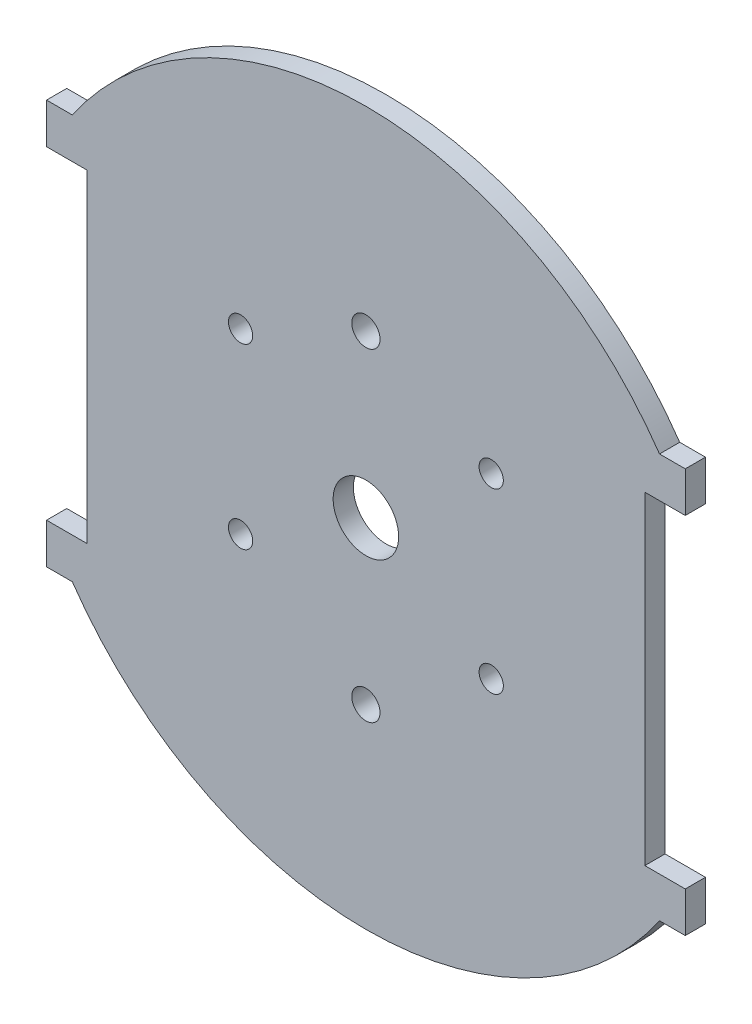
ISO-10303-21;
HEADER;
FILE_DESCRIPTION(('STEP AP214'),'2;1');
FILE_NAME('part.step','',(''),(''),'','','');
FILE_SCHEMA(('AUTOMOTIVE_DESIGN { 1 0 10303 214 1 1 1 1 }'));
ENDSEC;
DATA;
#1=APPLICATION_CONTEXT('core data for automotive mechanical design processes');
#2=APPLICATION_PROTOCOL_DEFINITION('international standard','automotive_design',2000,#1);
#3=PRODUCT_CONTEXT('',#1,'mechanical');
#4=PRODUCT('Part','Part','',(#3));
#5=PRODUCT_RELATED_PRODUCT_CATEGORY('part','',(#4));
#6=PRODUCT_DEFINITION_FORMATION('','',#4);
#7=PRODUCT_DEFINITION_CONTEXT('part definition',#1,'design');
#8=PRODUCT_DEFINITION('design','',#6,#7);
#9=PRODUCT_DEFINITION_SHAPE('','',#8);
#10=(LENGTH_UNIT() NAMED_UNIT(*) SI_UNIT(.MILLI.,.METRE.));
#11=(NAMED_UNIT(*) PLANE_ANGLE_UNIT() SI_UNIT($,.RADIAN.));
#12=(NAMED_UNIT(*) SI_UNIT($,.STERADIAN.) SOLID_ANGLE_UNIT());
#13=UNCERTAINTY_MEASURE_WITH_UNIT(LENGTH_MEASURE(1.E-05),#10,'distance_accuracy_value','');
#14=(GEOMETRIC_REPRESENTATION_CONTEXT(3) GLOBAL_UNCERTAINTY_ASSIGNED_CONTEXT((#13)) GLOBAL_UNIT_ASSIGNED_CONTEXT((#10,
#11,#12)) REPRESENTATION_CONTEXT('',''));
#15=CARTESIAN_POINT('',(0.,0.,0.));
#16=DIRECTION('',(0.,0.,1.));
#17=DIRECTION('',(1.,0.,0.));
#18=AXIS2_PLACEMENT_3D('',#15,#16,#17);
#19=CARTESIAN_POINT('',(0.,0.,2.5));
#20=DIRECTION('',(0.,0.,1.));
#21=DIRECTION('',(1.,0.,0.));
#22=AXIS2_PLACEMENT_3D('',#19,#20,#21);
#23=PLANE('',#22);
#24=CARTESIAN_POINT('',(15.5,-9.49999999999999,2.5));
#25=DIRECTION('',(0.,0.,1.));
#26=DIRECTION('',(1.,0.,0.));
#27=AXIS2_PLACEMENT_3D('',#24,#25,#26);
#28=CIRCLE('',#27,1.5);
#29=CARTESIAN_POINT('',(17.,-9.49999999999999,2.5));
#30=VERTEX_POINT('',#29);
#31=EDGE_CURVE('E345',#30,#30,#28,.T.);
#32=ORIENTED_EDGE('',*,*,#31,.F.);
#33=EDGE_LOOP('',(#32));
#34=FACE_BOUND('',#33,.T.);
#35=CARTESIAN_POINT('',(15.5,12.5,2.5));
#36=DIRECTION('',(0.,0.,1.));
#37=DIRECTION('',(1.,0.,0.));
#38=AXIS2_PLACEMENT_3D('',#35,#36,#37);
#39=CIRCLE('',#38,1.5);
#40=CARTESIAN_POINT('',(17.,12.5,2.5));
#41=VERTEX_POINT('',#40);
#42=EDGE_CURVE('E355',#41,#41,#39,.T.);
#43=ORIENTED_EDGE('',*,*,#42,.F.);
#44=EDGE_LOOP('',(#43));
#45=FACE_BOUND('',#44,.T.);
#46=CARTESIAN_POINT('',(-15.5,12.5,2.5));
#47=DIRECTION('',(0.,0.,1.));
#48=DIRECTION('',(1.,0.,0.));
#49=AXIS2_PLACEMENT_3D('',#46,#47,#48);
#50=CIRCLE('',#49,1.5);
#51=CARTESIAN_POINT('',(-14.,12.5,2.5));
#52=VERTEX_POINT('',#51);
#53=EDGE_CURVE('E361',#52,#52,#50,.T.);
#54=ORIENTED_EDGE('',*,*,#53,.F.);
#55=EDGE_LOOP('',(#54));
#56=FACE_BOUND('',#55,.T.);
#57=CARTESIAN_POINT('',(-15.5,-9.49999999999999,2.5));
#58=DIRECTION('',(0.,0.,1.));
#59=DIRECTION('',(1.,0.,0.));
#60=AXIS2_PLACEMENT_3D('',#57,#58,#59);
#61=CIRCLE('',#60,1.5);
#62=CARTESIAN_POINT('',(-14.,-9.49999999999999,2.5));
#63=VERTEX_POINT('',#62);
#64=EDGE_CURVE('E367',#63,#63,#61,.T.);
#65=ORIENTED_EDGE('',*,*,#64,.F.);
#66=EDGE_LOOP('',(#65));
#67=FACE_BOUND('',#66,.T.);
#68=CARTESIAN_POINT('',(0.,20.,2.5));
#69=DIRECTION('',(0.,0.,1.));
#70=DIRECTION('',(1.,0.,0.));
#71=AXIS2_PLACEMENT_3D('',#68,#69,#70);
#72=CIRCLE('',#71,1.75);
#73=CARTESIAN_POINT('',(1.75,20.,2.5));
#74=VERTEX_POINT('',#73);
#75=EDGE_CURVE('E377',#74,#74,#72,.T.);
#76=ORIENTED_EDGE('',*,*,#75,.F.);
#77=EDGE_LOOP('',(#76));
#78=FACE_BOUND('',#77,.T.);
#79=DIRECTION('',(-1.,0.,0.));
#80=VECTOR('',#79,1.);
#81=CARTESIAN_POINT('',(-39.5003462788418,-20.,2.5));
#82=LINE('',#81,#80);
#83=CARTESIAN_POINT('',(-34.5003462788418,-20.,2.5));
#84=VERTEX_POINT('',#83);
#85=CARTESIAN_POINT('',(-39.5003462788418,-20.,2.5));
#86=VERTEX_POINT('',#85);
#87=EDGE_CURVE('E208',#84,#86,#82,.T.);
#88=ORIENTED_EDGE('',*,*,#87,.T.);
#89=DIRECTION('',(0.,-1.,0.));
#90=VECTOR('',#89,1.);
#91=CARTESIAN_POINT('',(-39.5003462788418,-20.,2.5));
#92=LINE('',#91,#90);
#93=CARTESIAN_POINT('',(-39.5003462788418,-25.,2.5));
#94=VERTEX_POINT('',#93);
#95=EDGE_CURVE('E116',#86,#94,#92,.T.);
#96=ORIENTED_EDGE('',*,*,#95,.T.);
#97=DIRECTION('',(1.,0.,0.));
#98=VECTOR('',#97,1.);
#99=CARTESIAN_POINT('',(-39.5003462788418,-25.,2.5));
#100=LINE('',#99,#98);
#101=CARTESIAN_POINT('',(-36.3170497149755,-25.,2.5));
#102=VERTEX_POINT('',#101);
#103=EDGE_CURVE('E247',#94,#102,#100,.T.);
#104=ORIENTED_EDGE('',*,*,#103,.T.);
#105=CARTESIAN_POINT('',(0.,0.,2.5));
#106=DIRECTION('',(0.,0.,1.));
#107=DIRECTION('',(1.,0.,0.));
#108=AXIS2_PLACEMENT_3D('',#105,#106,#107);
#109=CIRCLE('',#108,44.09);
#110=CARTESIAN_POINT('',(36.3170497149751,-25.0000000000006,2.5));
#111=VERTEX_POINT('',#110);
#112=EDGE_CURVE('E266',#102,#111,#109,.T.);
#113=ORIENTED_EDGE('',*,*,#112,.T.);
#114=DIRECTION('',(1.,0.,0.));
#115=VECTOR('',#114,1.);
#116=CARTESIAN_POINT('',(36.3170497149751,-25.0000000000006,2.5));
#117=LINE('',#116,#115);
#118=CARTESIAN_POINT('',(39.5003462788415,-25.0000000000006,2.5));
#119=VERTEX_POINT('',#118);
#120=EDGE_CURVE('E263',#111,#119,#117,.T.);
#121=ORIENTED_EDGE('',*,*,#120,.T.);
#122=DIRECTION('',(0.,1.,0.));
#123=VECTOR('',#122,1.);
#124=CARTESIAN_POINT('',(39.5003462788415,-20.0000000000007,2.5));
#125=LINE('',#124,#123);
#126=CARTESIAN_POINT('',(39.5003462788415,-20.0000000000007,2.5));
#127=VERTEX_POINT('',#126);
#128=EDGE_CURVE('E265',#119,#127,#125,.T.);
#129=ORIENTED_EDGE('',*,*,#128,.T.);
#130=DIRECTION('',(-1.,0.,0.));
#131=VECTOR('',#130,1.);
#132=CARTESIAN_POINT('',(39.5003462788415,-20.0000000000007,2.5));
#133=LINE('',#132,#131);
#134=CARTESIAN_POINT('',(34.5003462788415,-20.0000000000007,2.5));
#135=VERTEX_POINT('',#134);
#136=EDGE_CURVE('E268',#127,#135,#133,.T.);
#137=ORIENTED_EDGE('',*,*,#136,.T.);
#138=DIRECTION('',(0.,1.,0.));
#139=VECTOR('',#138,1.);
#140=CARTESIAN_POINT('',(34.5003462788414,20.0000000000007,2.5));
#141=LINE('',#140,#139);
#142=CARTESIAN_POINT('',(34.5003462788414,20.0000000000007,2.5));
#143=VERTEX_POINT('',#142);
#144=EDGE_CURVE('E274',#135,#143,#141,.T.);
#145=ORIENTED_EDGE('',*,*,#144,.T.);
#146=DIRECTION('',(1.,0.,0.));
#147=VECTOR('',#146,1.);
#148=CARTESIAN_POINT('',(39.5003462788414,20.0000000000007,2.5));
#149=LINE('',#148,#147);
#150=CARTESIAN_POINT('',(39.5003462788414,20.0000000000007,2.5));
#151=VERTEX_POINT('',#150);
#152=EDGE_CURVE('E276',#143,#151,#149,.T.);
#153=ORIENTED_EDGE('',*,*,#152,.T.);
#154=DIRECTION('',(0.,1.,0.));
#155=VECTOR('',#154,1.);
#156=CARTESIAN_POINT('',(39.5003462788414,20.0000000000007,2.5));
#157=LINE('',#156,#155);
#158=CARTESIAN_POINT('',(39.5003462788414,25.0000000000006,2.5));
#159=VERTEX_POINT('',#158);
#160=EDGE_CURVE('E278',#151,#159,#157,.T.);
#161=ORIENTED_EDGE('',*,*,#160,.T.);
#162=DIRECTION('',(-1.,0.,0.));
#163=VECTOR('',#162,1.);
#164=CARTESIAN_POINT('',(36.3170497149751,25.0000000000006,2.5));
#165=LINE('',#164,#163);
#166=CARTESIAN_POINT('',(36.3170497149751,25.0000000000006,2.5));
#167=VERTEX_POINT('',#166);
#168=EDGE_CURVE('E280',#159,#167,#165,.T.);
#169=ORIENTED_EDGE('',*,*,#168,.T.);
#170=CARTESIAN_POINT('',(0.,0.,2.5));
#171=DIRECTION('',(0.,0.,1.));
#172=DIRECTION('',(1.,0.,0.));
#173=AXIS2_PLACEMENT_3D('',#170,#171,#172);
#174=CIRCLE('',#173,44.09);
#175=CARTESIAN_POINT('',(-36.3170497149755,25.,2.5));
#176=VERTEX_POINT('',#175);
#177=EDGE_CURVE('E282',#167,#176,#174,.T.);
#178=ORIENTED_EDGE('',*,*,#177,.T.);
#179=DIRECTION('',(-1.,0.,0.));
#180=VECTOR('',#179,1.);
#181=CARTESIAN_POINT('',(-39.5003462788418,25.,2.5));
#182=LINE('',#181,#180);
#183=CARTESIAN_POINT('',(-39.5003462788418,25.,2.5));
#184=VERTEX_POINT('',#183);
#185=EDGE_CURVE('E159',#176,#184,#182,.T.);
#186=ORIENTED_EDGE('',*,*,#185,.T.);
#187=DIRECTION('',(0.,-1.,0.));
#188=VECTOR('',#187,1.);
#189=CARTESIAN_POINT('',(-39.5003462788418,20.,2.5));
#190=LINE('',#189,#188);
#191=CARTESIAN_POINT('',(-39.5003462788418,20.,2.5));
#192=VERTEX_POINT('',#191);
#193=EDGE_CURVE('E153',#184,#192,#190,.T.);
#194=ORIENTED_EDGE('',*,*,#193,.T.);
#195=DIRECTION('',(1.,0.,0.));
#196=VECTOR('',#195,1.);
#197=CARTESIAN_POINT('',(-39.5003462788418,20.,2.5));
#198=LINE('',#197,#196);
#199=CARTESIAN_POINT('',(-34.5003462788418,20.,2.5));
#200=VERTEX_POINT('',#199);
#201=EDGE_CURVE('E157',#192,#200,#198,.T.);
#202=ORIENTED_EDGE('',*,*,#201,.T.);
#203=DIRECTION('',(0.,-1.,0.));
#204=VECTOR('',#203,1.);
#205=CARTESIAN_POINT('',(-34.5003462788418,20.,2.5));
#206=LINE('',#205,#204);
#207=EDGE_CURVE('E49',#200,#84,#206,.T.);
#208=ORIENTED_EDGE('',*,*,#207,.T.);
#209=EDGE_LOOP('',(#88,#96,#104,#113,#121,#129,#137,#145,#153,#161,#169,#178,#186,#194,#202,#208));
#210=FACE_BOUND('',#209,.T.);
#211=CARTESIAN_POINT('',(0.,0.,2.5));
#212=DIRECTION('',(0.,0.,1.));
#213=DIRECTION('',(1.,0.,0.));
#214=AXIS2_PLACEMENT_3D('',#211,#212,#213);
#215=CIRCLE('',#214,4.05);
#216=CARTESIAN_POINT('',(4.05,0.,2.5));
#217=VERTEX_POINT('',#216);
#218=EDGE_CURVE('E181',#217,#217,#215,.T.);
#219=ORIENTED_EDGE('',*,*,#218,.F.);
#220=EDGE_LOOP('',(#219));
#221=FACE_BOUND('',#220,.T.);
#222=CARTESIAN_POINT('',(0.,-20.,2.5));
#223=DIRECTION('',(0.,0.,1.));
#224=DIRECTION('',(1.,0.,0.));
#225=AXIS2_PLACEMENT_3D('',#222,#223,#224);
#226=CIRCLE('',#225,1.75);
#227=CARTESIAN_POINT('',(1.75,-20.,2.5));
#228=VERTEX_POINT('',#227);
#229=EDGE_CURVE('E371',#228,#228,#226,.T.);
#230=ORIENTED_EDGE('',*,*,#229,.F.);
#231=EDGE_LOOP('',(#230));
#232=FACE_BOUND('',#231,.T.);
#233=ADVANCED_FACE('F32',(#34,#45,#56,#67,#78,#210,#221,#232),#23,.T.);
#234=CARTESIAN_POINT('',(0.,0.,0.));
#235=DIRECTION('',(0.,0.,1.));
#236=DIRECTION('',(1.,0.,0.));
#237=AXIS2_PLACEMENT_3D('',#234,#235,#236);
#238=PLANE('',#237);
#239=CARTESIAN_POINT('',(15.5,-9.49999999999999,0.));
#240=DIRECTION('',(0.,0.,-1.));
#241=DIRECTION('',(-1.,0.,0.));
#242=AXIS2_PLACEMENT_3D('',#239,#240,#241);
#243=CIRCLE('',#242,1.5);
#244=CARTESIAN_POINT('',(14.,-9.49999999999999,0.));
#245=VERTEX_POINT('',#244);
#246=EDGE_CURVE('E348',#245,#245,#243,.T.);
#247=ORIENTED_EDGE('',*,*,#246,.F.);
#248=EDGE_LOOP('',(#247));
#249=FACE_BOUND('',#248,.T.);
#250=CARTESIAN_POINT('',(15.5,12.5,0.));
#251=DIRECTION('',(0.,0.,-1.));
#252=DIRECTION('',(-1.,0.,0.));
#253=AXIS2_PLACEMENT_3D('',#250,#251,#252);
#254=CIRCLE('',#253,1.5);
#255=CARTESIAN_POINT('',(14.,12.5,0.));
#256=VERTEX_POINT('',#255);
#257=EDGE_CURVE('E350',#256,#256,#254,.T.);
#258=ORIENTED_EDGE('',*,*,#257,.F.);
#259=EDGE_LOOP('',(#258));
#260=FACE_BOUND('',#259,.T.);
#261=CARTESIAN_POINT('',(-15.5,12.5,0.));
#262=DIRECTION('',(0.,0.,-1.));
#263=DIRECTION('',(-1.,0.,0.));
#264=AXIS2_PLACEMENT_3D('',#261,#262,#263);
#265=CIRCLE('',#264,1.5);
#266=CARTESIAN_POINT('',(-17.,12.5,0.));
#267=VERTEX_POINT('',#266);
#268=EDGE_CURVE('E358',#267,#267,#265,.T.);
#269=ORIENTED_EDGE('',*,*,#268,.F.);
#270=EDGE_LOOP('',(#269));
#271=FACE_BOUND('',#270,.T.);
#272=CARTESIAN_POINT('',(-15.5,-9.49999999999999,0.));
#273=DIRECTION('',(0.,0.,-1.));
#274=DIRECTION('',(-1.,0.,0.));
#275=AXIS2_PLACEMENT_3D('',#272,#273,#274);
#276=CIRCLE('',#275,1.5);
#277=CARTESIAN_POINT('',(-17.,-9.49999999999999,0.));
#278=VERTEX_POINT('',#277);
#279=EDGE_CURVE('E364',#278,#278,#276,.T.);
#280=ORIENTED_EDGE('',*,*,#279,.F.);
#281=EDGE_LOOP('',(#280));
#282=FACE_BOUND('',#281,.T.);
#283=CARTESIAN_POINT('',(0.,20.,0.));
#284=DIRECTION('',(0.,0.,1.));
#285=DIRECTION('',(1.,0.,0.));
#286=AXIS2_PLACEMENT_3D('',#283,#284,#285);
#287=CIRCLE('',#286,1.75);
#288=CARTESIAN_POINT('',(1.75,20.,0.));
#289=VERTEX_POINT('',#288);
#290=EDGE_CURVE('E374',#289,#289,#287,.T.);
#291=ORIENTED_EDGE('',*,*,#290,.T.);
#292=EDGE_LOOP('',(#291));
#293=FACE_BOUND('',#292,.T.);
#294=DIRECTION('',(-1.,0.,0.));
#295=VECTOR('',#294,1.);
#296=CARTESIAN_POINT('',(-39.5003462788418,-20.,0.));
#297=LINE('',#296,#295);
#298=CARTESIAN_POINT('',(-34.5003462788418,-20.,0.));
#299=VERTEX_POINT('',#298);
#300=CARTESIAN_POINT('',(-39.5003462788418,-20.,0.));
#301=VERTEX_POINT('',#300);
#302=EDGE_CURVE('E177',#299,#301,#297,.T.);
#303=ORIENTED_EDGE('',*,*,#302,.F.);
#304=DIRECTION('',(0.,-1.,0.));
#305=VECTOR('',#304,1.);
#306=CARTESIAN_POINT('',(-34.5003462788418,20.,0.));
#307=LINE('',#306,#305);
#308=CARTESIAN_POINT('',(-34.5003462788418,20.,0.));
#309=VERTEX_POINT('',#308);
#310=EDGE_CURVE('E108',#309,#299,#307,.T.);
#311=ORIENTED_EDGE('',*,*,#310,.F.);
#312=DIRECTION('',(1.,0.,0.));
#313=VECTOR('',#312,1.);
#314=CARTESIAN_POINT('',(-39.5003462788418,20.,0.));
#315=LINE('',#314,#313);
#316=CARTESIAN_POINT('',(-39.5003462788418,20.,0.));
#317=VERTEX_POINT('',#316);
#318=EDGE_CURVE('E102',#317,#309,#315,.T.);
#319=ORIENTED_EDGE('',*,*,#318,.F.);
#320=DIRECTION('',(0.,-1.,0.));
#321=VECTOR('',#320,1.);
#322=CARTESIAN_POINT('',(-39.5003462788418,20.,0.));
#323=LINE('',#322,#321);
#324=CARTESIAN_POINT('',(-39.5003462788418,25.,0.));
#325=VERTEX_POINT('',#324);
#326=EDGE_CURVE('E167',#325,#317,#323,.T.);
#327=ORIENTED_EDGE('',*,*,#326,.F.);
#328=DIRECTION('',(-1.,0.,0.));
#329=VECTOR('',#328,1.);
#330=CARTESIAN_POINT('',(-39.5003462788418,25.,0.));
#331=LINE('',#330,#329);
#332=CARTESIAN_POINT('',(-36.3170497149755,25.,0.));
#333=VERTEX_POINT('',#332);
#334=EDGE_CURVE('E203',#333,#325,#331,.T.);
#335=ORIENTED_EDGE('',*,*,#334,.F.);
#336=CARTESIAN_POINT('',(0.,0.,0.));
#337=DIRECTION('',(0.,0.,1.));
#338=DIRECTION('',(1.,0.,0.));
#339=AXIS2_PLACEMENT_3D('',#336,#337,#338);
#340=CIRCLE('',#339,44.09);
#341=CARTESIAN_POINT('',(36.3170497149751,25.0000000000006,0.));
#342=VERTEX_POINT('',#341);
#343=EDGE_CURVE('E201',#342,#333,#340,.T.);
#344=ORIENTED_EDGE('',*,*,#343,.F.);
#345=DIRECTION('',(-1.,0.,0.));
#346=VECTOR('',#345,1.);
#347=CARTESIAN_POINT('',(36.3170497149751,25.0000000000006,0.));
#348=LINE('',#347,#346);
#349=CARTESIAN_POINT('',(39.5003462788414,25.0000000000006,0.));
#350=VERTEX_POINT('',#349);
#351=EDGE_CURVE('E199',#350,#342,#348,.T.);
#352=ORIENTED_EDGE('',*,*,#351,.F.);
#353=DIRECTION('',(0.,1.,0.));
#354=VECTOR('',#353,1.);
#355=CARTESIAN_POINT('',(39.5003462788414,20.0000000000007,0.));
#356=LINE('',#355,#354);
#357=CARTESIAN_POINT('',(39.5003462788414,20.0000000000007,0.));
#358=VERTEX_POINT('',#357);
#359=EDGE_CURVE('E197',#358,#350,#356,.T.);
#360=ORIENTED_EDGE('',*,*,#359,.F.);
#361=DIRECTION('',(1.,0.,0.));
#362=VECTOR('',#361,1.);
#363=CARTESIAN_POINT('',(39.5003462788414,20.0000000000007,0.));
#364=LINE('',#363,#362);
#365=CARTESIAN_POINT('',(34.5003462788414,20.0000000000007,0.));
#366=VERTEX_POINT('',#365);
#367=EDGE_CURVE('E195',#366,#358,#364,.T.);
#368=ORIENTED_EDGE('',*,*,#367,.F.);
#369=DIRECTION('',(0.,1.,0.));
#370=VECTOR('',#369,1.);
#371=CARTESIAN_POINT('',(34.5003462788414,20.0000000000007,0.));
#372=LINE('',#371,#370);
#373=CARTESIAN_POINT('',(34.5003462788415,-20.0000000000007,0.));
#374=VERTEX_POINT('',#373);
#375=EDGE_CURVE('E193',#374,#366,#372,.T.);
#376=ORIENTED_EDGE('',*,*,#375,.F.);
#377=DIRECTION('',(-1.,0.,0.));
#378=VECTOR('',#377,1.);
#379=CARTESIAN_POINT('',(39.5003462788415,-20.0000000000007,0.));
#380=LINE('',#379,#378);
#381=CARTESIAN_POINT('',(39.5003462788415,-20.0000000000007,0.));
#382=VERTEX_POINT('',#381);
#383=EDGE_CURVE('E191',#382,#374,#380,.T.);
#384=ORIENTED_EDGE('',*,*,#383,.F.);
#385=DIRECTION('',(0.,1.,0.));
#386=VECTOR('',#385,1.);
#387=CARTESIAN_POINT('',(39.5003462788415,-20.0000000000007,0.));
#388=LINE('',#387,#386);
#389=CARTESIAN_POINT('',(39.5003462788415,-25.0000000000006,0.));
#390=VERTEX_POINT('',#389);
#391=EDGE_CURVE('E189',#390,#382,#388,.T.);
#392=ORIENTED_EDGE('',*,*,#391,.F.);
#393=DIRECTION('',(1.,0.,0.));
#394=VECTOR('',#393,1.);
#395=CARTESIAN_POINT('',(36.3170497149751,-25.0000000000006,0.));
#396=LINE('',#395,#394);
#397=CARTESIAN_POINT('',(36.3170497149751,-25.0000000000006,0.));
#398=VERTEX_POINT('',#397);
#399=EDGE_CURVE('E187',#398,#390,#396,.T.);
#400=ORIENTED_EDGE('',*,*,#399,.F.);
#401=CARTESIAN_POINT('',(0.,0.,0.));
#402=DIRECTION('',(0.,0.,1.));
#403=DIRECTION('',(1.,0.,0.));
#404=AXIS2_PLACEMENT_3D('',#401,#402,#403);
#405=CIRCLE('',#404,44.09);
#406=CARTESIAN_POINT('',(-36.3170497149755,-25.,0.));
#407=VERTEX_POINT('',#406);
#408=EDGE_CURVE('E185',#407,#398,#405,.T.);
#409=ORIENTED_EDGE('',*,*,#408,.F.);
#410=DIRECTION('',(1.,0.,0.));
#411=VECTOR('',#410,1.);
#412=CARTESIAN_POINT('',(-39.5003462788418,-25.,0.));
#413=LINE('',#412,#411);
#414=CARTESIAN_POINT('',(-39.5003462788418,-25.,0.));
#415=VERTEX_POINT('',#414);
#416=EDGE_CURVE('E183',#415,#407,#413,.T.);
#417=ORIENTED_EDGE('',*,*,#416,.F.);
#418=DIRECTION('',(0.,-1.,0.));
#419=VECTOR('',#418,1.);
#420=CARTESIAN_POINT('',(-39.5003462788418,-20.,0.));
#421=LINE('',#420,#419);
#422=EDGE_CURVE('E180',#301,#415,#421,.T.);
#423=ORIENTED_EDGE('',*,*,#422,.F.);
#424=EDGE_LOOP('',(#303,#311,#319,#327,#335,#344,#352,#360,#368,#376,#384,#392,#400,#409,#417,#423));
#425=FACE_BOUND('',#424,.T.);
#426=CARTESIAN_POINT('',(0.,0.,0.));
#427=DIRECTION('',(0.,0.,1.));
#428=DIRECTION('',(1.,0.,0.));
#429=AXIS2_PLACEMENT_3D('',#426,#427,#428);
#430=CIRCLE('',#429,4.05);
#431=CARTESIAN_POINT('',(4.05,0.,0.));
#432=VERTEX_POINT('',#431);
#433=EDGE_CURVE('E380',#432,#432,#430,.T.);
#434=ORIENTED_EDGE('',*,*,#433,.T.);
#435=EDGE_LOOP('',(#434));
#436=FACE_BOUND('',#435,.T.);
#437=CARTESIAN_POINT('',(0.,-20.,0.));
#438=DIRECTION('',(0.,0.,1.));
#439=DIRECTION('',(1.,0.,0.));
#440=AXIS2_PLACEMENT_3D('',#437,#438,#439);
#441=CIRCLE('',#440,1.75);
#442=CARTESIAN_POINT('',(1.75,-20.,0.));
#443=VERTEX_POINT('',#442);
#444=EDGE_CURVE('E370',#443,#443,#441,.T.);
#445=ORIENTED_EDGE('',*,*,#444,.T.);
#446=EDGE_LOOP('',(#445));
#447=FACE_BOUND('',#446,.T.);
#448=ADVANCED_FACE('F251',(#249,#260,#271,#282,#293,#425,#436,#447),#238,.F.);
#449=CARTESIAN_POINT('',(-39.5003462788418,-20.,2.5));
#450=DIRECTION('',(0.,-1.,0.));
#451=DIRECTION('',(0.,0.,-1.));
#452=AXIS2_PLACEMENT_3D('',#449,#450,#451);
#453=PLANE('',#452);
#454=ORIENTED_EDGE('',*,*,#302,.T.);
#455=DIRECTION('',(0.,0.,-1.));
#456=VECTOR('',#455,1.);
#457=CARTESIAN_POINT('',(-39.5003462788418,-20.,2.5));
#458=LINE('',#457,#456);
#459=EDGE_CURVE('E11',#86,#301,#458,.T.);
#460=ORIENTED_EDGE('',*,*,#459,.F.);
#461=ORIENTED_EDGE('',*,*,#87,.F.);
#462=DIRECTION('',(0.,0.,-1.));
#463=VECTOR('',#462,1.);
#464=CARTESIAN_POINT('',(-34.5003462788418,-20.,2.5));
#465=LINE('',#464,#463);
#466=EDGE_CURVE('E173',#84,#299,#465,.T.);
#467=ORIENTED_EDGE('',*,*,#466,.T.);
#468=EDGE_LOOP('',(#454,#460,#461,#467));
#469=FACE_BOUND('',#468,.T.);
#470=ADVANCED_FACE('F34',(#469),#453,.F.);
#471=CARTESIAN_POINT('',(-39.5003462788418,-20.,2.5));
#472=DIRECTION('',(1.,0.,0.));
#473=DIRECTION('',(0.,0.,-1.));
#474=AXIS2_PLACEMENT_3D('',#471,#472,#473);
#475=PLANE('',#474);
#476=ORIENTED_EDGE('',*,*,#422,.T.);
#477=DIRECTION('',(0.,0.,-1.));
#478=VECTOR('',#477,1.);
#479=CARTESIAN_POINT('',(-39.5003462788418,-25.,2.5));
#480=LINE('',#479,#478);
#481=EDGE_CURVE('E41',#94,#415,#480,.T.);
#482=ORIENTED_EDGE('',*,*,#481,.F.);
#483=ORIENTED_EDGE('',*,*,#95,.F.);
#484=ORIENTED_EDGE('',*,*,#459,.T.);
#485=EDGE_LOOP('',(#476,#482,#483,#484));
#486=FACE_BOUND('',#485,.T.);
#487=ADVANCED_FACE('F559',(#486),#475,.F.);
#488=CARTESIAN_POINT('',(-39.5003462788418,-25.,2.5));
#489=DIRECTION('',(0.,1.,0.));
#490=DIRECTION('',(0.,0.,1.));
#491=AXIS2_PLACEMENT_3D('',#488,#489,#490);
#492=PLANE('',#491);
#493=ORIENTED_EDGE('',*,*,#416,.T.);
#494=DIRECTION('',(0.,0.,-1.));
#495=VECTOR('',#494,1.);
#496=CARTESIAN_POINT('',(-36.3170497149755,-25.,2.5));
#497=LINE('',#496,#495);
#498=EDGE_CURVE('E239',#102,#407,#497,.T.);
#499=ORIENTED_EDGE('',*,*,#498,.F.);
#500=ORIENTED_EDGE('',*,*,#103,.F.);
#501=ORIENTED_EDGE('',*,*,#481,.T.);
#502=EDGE_LOOP('',(#493,#499,#500,#501));
#503=FACE_BOUND('',#502,.T.);
#504=ADVANCED_FACE('F245',(#503),#492,.F.);
#505=CARTESIAN_POINT('',(0.,0.,2.5));
#506=DIRECTION('',(0.,0.,-1.));
#507=DIRECTION('',(-1.,0.,0.));
#508=AXIS2_PLACEMENT_3D('',#505,#506,#507);
#509=CYLINDRICAL_SURFACE('',#508,44.09);
#510=ORIENTED_EDGE('',*,*,#408,.T.);
#511=DIRECTION('',(0.,0.,-1.));
#512=VECTOR('',#511,1.);
#513=CARTESIAN_POINT('',(36.3170497149751,-25.0000000000006,2.5));
#514=LINE('',#513,#512);
#515=EDGE_CURVE('E236',#111,#398,#514,.T.);
#516=ORIENTED_EDGE('',*,*,#515,.F.);
#517=ORIENTED_EDGE('',*,*,#112,.F.);
#518=ORIENTED_EDGE('',*,*,#498,.T.);
#519=EDGE_LOOP('',(#510,#516,#517,#518));
#520=FACE_BOUND('',#519,.T.);
#521=ADVANCED_FACE('F257',(#520),#509,.T.);
#522=CARTESIAN_POINT('',(36.3170497149751,-25.0000000000006,2.5));
#523=DIRECTION('',(0.,1.,0.));
#524=DIRECTION('',(0.,0.,1.));
#525=AXIS2_PLACEMENT_3D('',#522,#523,#524);
#526=PLANE('',#525);
#527=ORIENTED_EDGE('',*,*,#399,.T.);
#528=DIRECTION('',(0.,0.,-1.));
#529=VECTOR('',#528,1.);
#530=CARTESIAN_POINT('',(39.5003462788415,-25.0000000000006,2.5));
#531=LINE('',#530,#529);
#532=EDGE_CURVE('E233',#119,#390,#531,.T.);
#533=ORIENTED_EDGE('',*,*,#532,.F.);
#534=ORIENTED_EDGE('',*,*,#120,.F.);
#535=ORIENTED_EDGE('',*,*,#515,.T.);
#536=EDGE_LOOP('',(#527,#533,#534,#535));
#537=FACE_BOUND('',#536,.T.);
#538=ADVANCED_FACE('F261',(#537),#526,.F.);
#539=CARTESIAN_POINT('',(39.5003462788415,-20.0000000000007,2.5));
#540=DIRECTION('',(-1.,0.,0.));
#541=DIRECTION('',(0.,0.,1.));
#542=AXIS2_PLACEMENT_3D('',#539,#540,#541);
#543=PLANE('',#542);
#544=ORIENTED_EDGE('',*,*,#391,.T.);
#545=DIRECTION('',(0.,0.,-1.));
#546=VECTOR('',#545,1.);
#547=CARTESIAN_POINT('',(39.5003462788415,-20.0000000000007,2.5));
#548=LINE('',#547,#546);
#549=EDGE_CURVE('E230',#127,#382,#548,.T.);
#550=ORIENTED_EDGE('',*,*,#549,.F.);
#551=ORIENTED_EDGE('',*,*,#128,.F.);
#552=ORIENTED_EDGE('',*,*,#532,.T.);
#553=EDGE_LOOP('',(#544,#550,#551,#552));
#554=FACE_BOUND('',#553,.T.);
#555=ADVANCED_FACE('F524',(#554),#543,.F.);
#556=CARTESIAN_POINT('',(39.5003462788415,-20.0000000000007,2.5));
#557=DIRECTION('',(0.,-1.,0.));
#558=DIRECTION('',(0.,0.,-1.));
#559=AXIS2_PLACEMENT_3D('',#556,#557,#558);
#560=PLANE('',#559);
#561=ORIENTED_EDGE('',*,*,#383,.T.);
#562=DIRECTION('',(0.,0.,-1.));
#563=VECTOR('',#562,1.);
#564=CARTESIAN_POINT('',(34.5003462788415,-20.0000000000007,2.5));
#565=LINE('',#564,#563);
#566=EDGE_CURVE('E227',#135,#374,#565,.T.);
#567=ORIENTED_EDGE('',*,*,#566,.F.);
#568=ORIENTED_EDGE('',*,*,#136,.F.);
#569=ORIENTED_EDGE('',*,*,#549,.T.);
#570=EDGE_LOOP('',(#561,#567,#568,#569));
#571=FACE_BOUND('',#570,.T.);
#572=ADVANCED_FACE('F514',(#571),#560,.F.);
#573=CARTESIAN_POINT('',(34.5003462788414,20.0000000000007,2.5));
#574=DIRECTION('',(-1.,0.,0.));
#575=DIRECTION('',(0.,-1.,0.));
#576=AXIS2_PLACEMENT_3D('',#573,#574,#575);
#577=PLANE('',#576);
#578=ORIENTED_EDGE('',*,*,#375,.T.);
#579=DIRECTION('',(0.,0.,-1.));
#580=VECTOR('',#579,1.);
#581=CARTESIAN_POINT('',(34.5003462788414,20.0000000000007,2.5));
#582=LINE('',#581,#580);
#583=EDGE_CURVE('E224',#143,#366,#582,.T.);
#584=ORIENTED_EDGE('',*,*,#583,.F.);
#585=ORIENTED_EDGE('',*,*,#144,.F.);
#586=ORIENTED_EDGE('',*,*,#566,.T.);
#587=EDGE_LOOP('',(#578,#584,#585,#586));
#588=FACE_BOUND('',#587,.T.);
#589=ADVANCED_FACE('F504',(#588),#577,.F.);
#590=CARTESIAN_POINT('',(39.5003462788414,20.0000000000007,2.5));
#591=DIRECTION('',(0.,1.,0.));
#592=DIRECTION('',(0.,0.,1.));
#593=AXIS2_PLACEMENT_3D('',#590,#591,#592);
#594=PLANE('',#593);
#595=ORIENTED_EDGE('',*,*,#367,.T.);
#596=DIRECTION('',(0.,0.,-1.));
#597=VECTOR('',#596,1.);
#598=CARTESIAN_POINT('',(39.5003462788414,20.0000000000007,2.5));
#599=LINE('',#598,#597);
#600=EDGE_CURVE('E221',#151,#358,#599,.T.);
#601=ORIENTED_EDGE('',*,*,#600,.F.);
#602=ORIENTED_EDGE('',*,*,#152,.F.);
#603=ORIENTED_EDGE('',*,*,#583,.T.);
#604=EDGE_LOOP('',(#595,#601,#602,#603));
#605=FACE_BOUND('',#604,.T.);
#606=ADVANCED_FACE('F494',(#605),#594,.F.);
#607=CARTESIAN_POINT('',(39.5003462788414,20.0000000000007,2.5));
#608=DIRECTION('',(-1.,0.,0.));
#609=DIRECTION('',(0.,0.,1.));
#610=AXIS2_PLACEMENT_3D('',#607,#608,#609);
#611=PLANE('',#610);
#612=ORIENTED_EDGE('',*,*,#359,.T.);
#613=DIRECTION('',(0.,0.,-1.));
#614=VECTOR('',#613,1.);
#615=CARTESIAN_POINT('',(39.5003462788414,25.0000000000006,2.5));
#616=LINE('',#615,#614);
#617=EDGE_CURVE('E218',#159,#350,#616,.T.);
#618=ORIENTED_EDGE('',*,*,#617,.F.);
#619=ORIENTED_EDGE('',*,*,#160,.F.);
#620=ORIENTED_EDGE('',*,*,#600,.T.);
#621=EDGE_LOOP('',(#612,#618,#619,#620));
#622=FACE_BOUND('',#621,.T.);
#623=ADVANCED_FACE('F484',(#622),#611,.F.);
#624=CARTESIAN_POINT('',(36.3170497149751,25.0000000000006,2.5));
#625=DIRECTION('',(0.,-1.,0.));
#626=DIRECTION('',(0.,0.,-1.));
#627=AXIS2_PLACEMENT_3D('',#624,#625,#626);
#628=PLANE('',#627);
#629=ORIENTED_EDGE('',*,*,#351,.T.);
#630=DIRECTION('',(0.,0.,-1.));
#631=VECTOR('',#630,1.);
#632=CARTESIAN_POINT('',(36.3170497149751,25.0000000000006,2.5));
#633=LINE('',#632,#631);
#634=EDGE_CURVE('E215',#167,#342,#633,.T.);
#635=ORIENTED_EDGE('',*,*,#634,.F.);
#636=ORIENTED_EDGE('',*,*,#168,.F.);
#637=ORIENTED_EDGE('',*,*,#617,.T.);
#638=EDGE_LOOP('',(#629,#635,#636,#637));
#639=FACE_BOUND('',#638,.T.);
#640=ADVANCED_FACE('F475',(#639),#628,.F.);
#641=CARTESIAN_POINT('',(0.,0.,2.5));
#642=DIRECTION('',(0.,0.,-1.));
#643=DIRECTION('',(-1.,0.,0.));
#644=AXIS2_PLACEMENT_3D('',#641,#642,#643);
#645=CYLINDRICAL_SURFACE('',#644,44.09);
#646=ORIENTED_EDGE('',*,*,#343,.T.);
#647=DIRECTION('',(0.,0.,-1.));
#648=VECTOR('',#647,1.);
#649=CARTESIAN_POINT('',(-36.3170497149755,25.,2.5));
#650=LINE('',#649,#648);
#651=EDGE_CURVE('E212',#176,#333,#650,.T.);
#652=ORIENTED_EDGE('',*,*,#651,.F.);
#653=ORIENTED_EDGE('',*,*,#177,.F.);
#654=ORIENTED_EDGE('',*,*,#634,.T.);
#655=EDGE_LOOP('',(#646,#652,#653,#654));
#656=FACE_BOUND('',#655,.T.);
#657=ADVANCED_FACE('F288',(#656),#645,.T.);
#658=CARTESIAN_POINT('',(-39.5003462788418,25.,2.5));
#659=DIRECTION('',(0.,-1.,0.));
#660=DIRECTION('',(0.,0.,-1.));
#661=AXIS2_PLACEMENT_3D('',#658,#659,#660);
#662=PLANE('',#661);
#663=ORIENTED_EDGE('',*,*,#334,.T.);
#664=DIRECTION('',(0.,0.,-1.));
#665=VECTOR('',#664,1.);
#666=CARTESIAN_POINT('',(-39.5003462788418,25.,2.5));
#667=LINE('',#666,#665);
#668=EDGE_CURVE('E168',#184,#325,#667,.T.);
#669=ORIENTED_EDGE('',*,*,#668,.F.);
#670=ORIENTED_EDGE('',*,*,#185,.F.);
#671=ORIENTED_EDGE('',*,*,#651,.T.);
#672=EDGE_LOOP('',(#663,#669,#670,#671));
#673=FACE_BOUND('',#672,.T.);
#674=ADVANCED_FACE('F292',(#673),#662,.F.);
#675=CARTESIAN_POINT('',(-39.5003462788418,20.,2.5));
#676=DIRECTION('',(1.,0.,0.));
#677=DIRECTION('',(0.,0.,-1.));
#678=AXIS2_PLACEMENT_3D('',#675,#676,#677);
#679=PLANE('',#678);
#680=ORIENTED_EDGE('',*,*,#326,.T.);
#681=DIRECTION('',(0.,0.,-1.));
#682=VECTOR('',#681,1.);
#683=CARTESIAN_POINT('',(-39.5003462788418,20.,2.5));
#684=LINE('',#683,#682);
#685=EDGE_CURVE('E164',#192,#317,#684,.T.);
#686=ORIENTED_EDGE('',*,*,#685,.F.);
#687=ORIENTED_EDGE('',*,*,#193,.F.);
#688=ORIENTED_EDGE('',*,*,#668,.T.);
#689=EDGE_LOOP('',(#680,#686,#687,#688));
#690=FACE_BOUND('',#689,.T.);
#691=ADVANCED_FACE('F165',(#690),#679,.F.);
#692=CARTESIAN_POINT('',(-39.5003462788418,20.,2.5));
#693=DIRECTION('',(0.,1.,0.));
#694=DIRECTION('',(0.,0.,1.));
#695=AXIS2_PLACEMENT_3D('',#692,#693,#694);
#696=PLANE('',#695);
#697=ORIENTED_EDGE('',*,*,#318,.T.);
#698=DIRECTION('',(0.,0.,-1.));
#699=VECTOR('',#698,1.);
#700=CARTESIAN_POINT('',(-34.5003462788418,20.,2.5));
#701=LINE('',#700,#699);
#702=EDGE_CURVE('E169',#200,#309,#701,.T.);
#703=ORIENTED_EDGE('',*,*,#702,.F.);
#704=ORIENTED_EDGE('',*,*,#201,.F.);
#705=ORIENTED_EDGE('',*,*,#685,.T.);
#706=EDGE_LOOP('',(#697,#703,#704,#705));
#707=FACE_BOUND('',#706,.T.);
#708=ADVANCED_FACE('F171',(#707),#696,.F.);
#709=CARTESIAN_POINT('',(-34.5003462788418,20.,2.5));
#710=DIRECTION('',(1.,0.,0.));
#711=DIRECTION('',(0.,1.,0.));
#712=AXIS2_PLACEMENT_3D('',#709,#710,#711);
#713=PLANE('',#712);
#714=ORIENTED_EDGE('',*,*,#310,.T.);
#715=ORIENTED_EDGE('',*,*,#466,.F.);
#716=ORIENTED_EDGE('',*,*,#207,.F.);
#717=ORIENTED_EDGE('',*,*,#702,.T.);
#718=EDGE_LOOP('',(#714,#715,#716,#717));
#719=FACE_BOUND('',#718,.T.);
#720=ADVANCED_FACE('F296',(#719),#713,.F.);
#721=CARTESIAN_POINT('',(0.,0.,2.5));
#722=DIRECTION('',(0.,0.,-1.));
#723=DIRECTION('',(-1.,0.,0.));
#724=AXIS2_PLACEMENT_3D('',#721,#722,#723);
#725=CYLINDRICAL_SURFACE('',#724,4.05);
#726=ORIENTED_EDGE('',*,*,#218,.T.);
#727=EDGE_LOOP('',(#726));
#728=FACE_BOUND('',#727,.T.);
#729=ORIENTED_EDGE('',*,*,#433,.F.);
#730=EDGE_LOOP('',(#729));
#731=FACE_BOUND('',#730,.T.);
#732=ADVANCED_FACE('F298',(#728,#731),#725,.F.);
#733=CARTESIAN_POINT('',(0.,20.,2.5));
#734=DIRECTION('',(0.,0.,-1.));
#735=DIRECTION('',(-1.,0.,0.));
#736=AXIS2_PLACEMENT_3D('',#733,#734,#735);
#737=CYLINDRICAL_SURFACE('',#736,1.75);
#738=ORIENTED_EDGE('',*,*,#75,.T.);
#739=EDGE_LOOP('',(#738));
#740=FACE_BOUND('',#739,.T.);
#741=ORIENTED_EDGE('',*,*,#290,.F.);
#742=EDGE_LOOP('',(#741));
#743=FACE_BOUND('',#742,.T.);
#744=ADVANCED_FACE('F304',(#740,#743),#737,.F.);
#745=CARTESIAN_POINT('',(0.,-20.,2.5));
#746=DIRECTION('',(0.,0.,-1.));
#747=DIRECTION('',(-1.,0.,0.));
#748=AXIS2_PLACEMENT_3D('',#745,#746,#747);
#749=CYLINDRICAL_SURFACE('',#748,1.75);
#750=ORIENTED_EDGE('',*,*,#229,.T.);
#751=EDGE_LOOP('',(#750));
#752=FACE_BOUND('',#751,.T.);
#753=ORIENTED_EDGE('',*,*,#444,.F.);
#754=EDGE_LOOP('',(#753));
#755=FACE_BOUND('',#754,.T.);
#756=ADVANCED_FACE('F321',(#752,#755),#749,.F.);
#757=CARTESIAN_POINT('',(-15.5,-9.49999999999999,4.));
#758=DIRECTION('',(0.,0.,-1.));
#759=DIRECTION('',(-1.,0.,0.));
#760=AXIS2_PLACEMENT_3D('',#757,#758,#759);
#761=CYLINDRICAL_SURFACE('',#760,1.5);
#762=ORIENTED_EDGE('',*,*,#64,.T.);
#763=EDGE_LOOP('',(#762));
#764=FACE_BOUND('',#763,.T.);
#765=ORIENTED_EDGE('',*,*,#279,.T.);
#766=EDGE_LOOP('',(#765));
#767=FACE_BOUND('',#766,.T.);
#768=ADVANCED_FACE('F325',(#764,#767),#761,.F.);
#769=CARTESIAN_POINT('',(-15.5,12.5,4.));
#770=DIRECTION('',(0.,0.,-1.));
#771=DIRECTION('',(-1.,0.,0.));
#772=AXIS2_PLACEMENT_3D('',#769,#770,#771);
#773=CYLINDRICAL_SURFACE('',#772,1.5);
#774=ORIENTED_EDGE('',*,*,#53,.T.);
#775=EDGE_LOOP('',(#774));
#776=FACE_BOUND('',#775,.T.);
#777=ORIENTED_EDGE('',*,*,#268,.T.);
#778=EDGE_LOOP('',(#777));
#779=FACE_BOUND('',#778,.T.);
#780=ADVANCED_FACE('F329',(#776,#779),#773,.F.);
#781=CARTESIAN_POINT('',(15.5,12.5,4.));
#782=DIRECTION('',(0.,0.,-1.));
#783=DIRECTION('',(-1.,0.,0.));
#784=AXIS2_PLACEMENT_3D('',#781,#782,#783);
#785=CYLINDRICAL_SURFACE('',#784,1.5);
#786=ORIENTED_EDGE('',*,*,#42,.T.);
#787=EDGE_LOOP('',(#786));
#788=FACE_BOUND('',#787,.T.);
#789=ORIENTED_EDGE('',*,*,#257,.T.);
#790=EDGE_LOOP('',(#789));
#791=FACE_BOUND('',#790,.T.);
#792=ADVANCED_FACE('F333',(#788,#791),#785,.F.);
#793=CARTESIAN_POINT('',(15.5,-9.49999999999999,4.));
#794=DIRECTION('',(0.,0.,-1.));
#795=DIRECTION('',(-1.,0.,0.));
#796=AXIS2_PLACEMENT_3D('',#793,#794,#795);
#797=CYLINDRICAL_SURFACE('',#796,1.5);
#798=ORIENTED_EDGE('',*,*,#31,.T.);
#799=EDGE_LOOP('',(#798));
#800=FACE_BOUND('',#799,.T.);
#801=ORIENTED_EDGE('',*,*,#246,.T.);
#802=EDGE_LOOP('',(#801));
#803=FACE_BOUND('',#802,.T.);
#804=ADVANCED_FACE('F337',(#800,#803),#797,.F.);
#805=CLOSED_SHELL('',(#233,#448,#470,#487,#504,#521,#538,#555,#572,#589,#606,#623,#640,#657,
#674,#691,#708,#720,#732,#744,#756,#768,#780,#792,#804));
#806=MANIFOLD_SOLID_BREP('B2',#805);
#807=ADVANCED_BREP_SHAPE_REPRESENTATION('',(#18,#806),#14);
#808=SHAPE_DEFINITION_REPRESENTATION(#9,#807);
ENDSEC;
END-ISO-10303-21;
